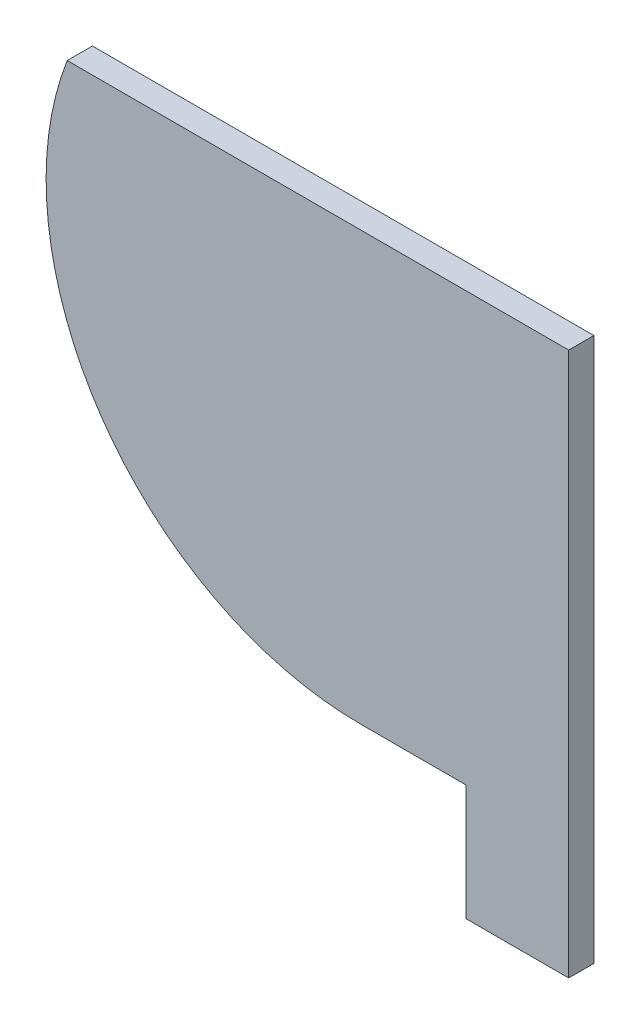
ISO-10303-21;
HEADER;
FILE_DESCRIPTION(('STEP AP214'),'2;1');
FILE_NAME('part.step','',(''),(''),'','','');
FILE_SCHEMA(('AUTOMOTIVE_DESIGN { 1 0 10303 214 1 1 1 1 }'));
ENDSEC;
DATA;
#1=APPLICATION_CONTEXT('core data for automotive mechanical design processes');
#2=APPLICATION_PROTOCOL_DEFINITION('international standard','automotive_design',2000,#1);
#3=PRODUCT_CONTEXT('',#1,'mechanical');
#4=PRODUCT('Part','Part','',(#3));
#5=PRODUCT_RELATED_PRODUCT_CATEGORY('part','',(#4));
#6=PRODUCT_DEFINITION_FORMATION('','',#4);
#7=PRODUCT_DEFINITION_CONTEXT('part definition',#1,'design');
#8=PRODUCT_DEFINITION('design','',#6,#7);
#9=PRODUCT_DEFINITION_SHAPE('','',#8);
#10=(LENGTH_UNIT() NAMED_UNIT(*) SI_UNIT(.MILLI.,.METRE.));
#11=(NAMED_UNIT(*) PLANE_ANGLE_UNIT() SI_UNIT($,.RADIAN.));
#12=(NAMED_UNIT(*) SI_UNIT($,.STERADIAN.) SOLID_ANGLE_UNIT());
#13=UNCERTAINTY_MEASURE_WITH_UNIT(LENGTH_MEASURE(1.E-05),#10,'distance_accuracy_value','');
#14=(GEOMETRIC_REPRESENTATION_CONTEXT(3) GLOBAL_UNCERTAINTY_ASSIGNED_CONTEXT((#13)) GLOBAL_UNIT_ASSIGNED_CONTEXT((#10,
#11,#12)) REPRESENTATION_CONTEXT('',''));
#15=CARTESIAN_POINT('',(0.,0.,0.));
#16=DIRECTION('',(0.,0.,1.));
#17=DIRECTION('',(1.,0.,0.));
#18=AXIS2_PLACEMENT_3D('',#15,#16,#17);
#19=CARTESIAN_POINT('',(-41.2805747146211,-85.,5.));
#20=DIRECTION('',(0.,1.,0.));
#21=DIRECTION('',(0.,0.,1.));
#22=AXIS2_PLACEMENT_3D('',#19,#20,#21);
#23=PLANE('',#22);
#24=DIRECTION('',(1.,0.,0.));
#25=VECTOR('',#24,1.);
#26=CARTESIAN_POINT('',(-41.2805747146211,-85.,0.));
#27=LINE('',#26,#25);
#28=CARTESIAN_POINT('',(-41.2805747146211,-85.,0.));
#29=VERTEX_POINT('',#28);
#30=CARTESIAN_POINT('',(-20.3801822065286,-85.,0.));
#31=VERTEX_POINT('',#30);
#32=EDGE_CURVE('E54',#29,#31,#27,.T.);
#33=ORIENTED_EDGE('',*,*,#32,.T.);
#34=DIRECTION('',(0.,0.,1.));
#35=VECTOR('',#34,1.);
#36=CARTESIAN_POINT('',(-20.3801822065286,-85.,0.));
#37=LINE('',#36,#35);
#38=CARTESIAN_POINT('',(-20.3801822065286,-85.,5.));
#39=VERTEX_POINT('',#38);
#40=EDGE_CURVE('E49',#31,#39,#37,.T.);
#41=ORIENTED_EDGE('',*,*,#40,.T.);
#42=DIRECTION('',(1.,0.,0.));
#43=VECTOR('',#42,1.);
#44=CARTESIAN_POINT('',(-41.2805747146211,-85.,5.));
#45=LINE('',#44,#43);
#46=CARTESIAN_POINT('',(-41.2805747146211,-85.,5.));
#47=VERTEX_POINT('',#46);
#48=EDGE_CURVE('E116',#47,#39,#45,.T.);
#49=ORIENTED_EDGE('',*,*,#48,.F.);
#50=DIRECTION('',(0.,0.,-1.));
#51=VECTOR('',#50,1.);
#52=CARTESIAN_POINT('',(-41.2805747146211,-85.,5.));
#53=LINE('',#52,#51);
#54=EDGE_CURVE('E125',#47,#29,#53,.T.);
#55=ORIENTED_EDGE('',*,*,#54,.T.);
#56=EDGE_LOOP('',(#33,#41,#49,#55));
#57=FACE_BOUND('',#56,.T.);
#58=ADVANCED_FACE('F35',(#57),#23,.F.);
#59=CARTESIAN_POINT('',(0.,0.,5.));
#60=DIRECTION('',(-1.,0.,0.));
#61=DIRECTION('',(0.,-1.,0.));
#62=AXIS2_PLACEMENT_3D('',#59,#60,#61);
#63=PLANE('',#62);
#64=DIRECTION('',(0.,1.,0.));
#65=VECTOR('',#64,1.);
#66=CARTESIAN_POINT('',(0.,0.,0.));
#67=LINE('',#66,#65);
#68=CARTESIAN_POINT('',(0.,-108.,0.));
#69=VERTEX_POINT('',#68);
#70=CARTESIAN_POINT('',(0.,0.,0.));
#71=VERTEX_POINT('',#70);
#72=EDGE_CURVE('E105',#69,#71,#67,.T.);
#73=ORIENTED_EDGE('',*,*,#72,.T.);
#74=DIRECTION('',(0.,0.,-1.));
#75=VECTOR('',#74,1.);
#76=CARTESIAN_POINT('',(0.,0.,5.));
#77=LINE('',#76,#75);
#78=CARTESIAN_POINT('',(0.,0.,5.));
#79=VERTEX_POINT('',#78);
#80=EDGE_CURVE('E11',#79,#71,#77,.T.);
#81=ORIENTED_EDGE('',*,*,#80,.F.);
#82=DIRECTION('',(0.,1.,0.));
#83=VECTOR('',#82,1.);
#84=CARTESIAN_POINT('',(0.,0.,5.));
#85=LINE('',#84,#83);
#86=CARTESIAN_POINT('',(0.,-108.,5.));
#87=VERTEX_POINT('',#86);
#88=EDGE_CURVE('E118',#87,#79,#85,.T.);
#89=ORIENTED_EDGE('',*,*,#88,.F.);
#90=DIRECTION('',(0.,0.,1.));
#91=VECTOR('',#90,1.);
#92=CARTESIAN_POINT('',(0.,-108.,0.));
#93=LINE('',#92,#91);
#94=EDGE_CURVE('E98',#69,#87,#93,.T.);
#95=ORIENTED_EDGE('',*,*,#94,.F.);
#96=EDGE_LOOP('',(#73,#81,#89,#95));
#97=FACE_BOUND('',#96,.T.);
#98=ADVANCED_FACE('F143',(#97),#63,.F.);
#99=CARTESIAN_POINT('',(0.,0.,5.));
#100=DIRECTION('',(0.,-1.,0.));
#101=DIRECTION('',(1.,0.,0.));
#102=AXIS2_PLACEMENT_3D('',#99,#100,#101);
#103=PLANE('',#102);
#104=DIRECTION('',(-1.,0.,0.));
#105=VECTOR('',#104,1.);
#106=CARTESIAN_POINT('',(0.,0.,0.));
#107=LINE('',#106,#105);
#108=CARTESIAN_POINT('',(-99.5900936630741,0.,0.));
#109=VERTEX_POINT('',#108);
#110=EDGE_CURVE('E128',#71,#109,#107,.T.);
#111=ORIENTED_EDGE('',*,*,#110,.T.);
#112=DIRECTION('',(0.,0.,-1.));
#113=VECTOR('',#112,1.);
#114=CARTESIAN_POINT('',(-99.5900936630741,0.,5.));
#115=LINE('',#114,#113);
#116=CARTESIAN_POINT('',(-99.5900936630741,0.,5.));
#117=VERTEX_POINT('',#116);
#118=EDGE_CURVE('E42',#117,#109,#115,.T.);
#119=ORIENTED_EDGE('',*,*,#118,.F.);
#120=DIRECTION('',(-1.,0.,0.));
#121=VECTOR('',#120,1.);
#122=CARTESIAN_POINT('',(0.,0.,5.));
#123=LINE('',#122,#121);
#124=EDGE_CURVE('E121',#79,#117,#123,.T.);
#125=ORIENTED_EDGE('',*,*,#124,.F.);
#126=ORIENTED_EDGE('',*,*,#80,.T.);
#127=EDGE_LOOP('',(#111,#119,#125,#126));
#128=FACE_BOUND('',#127,.T.);
#129=ADVANCED_FACE('F140',(#128),#103,.F.);
#130=CARTESIAN_POINT('',(-41.2805747146211,-22.5,5.));
#131=DIRECTION('',(0.,0.,-1.));
#132=DIRECTION('',(-1.,0.,0.));
#133=AXIS2_PLACEMENT_3D('',#130,#131,#132);
#134=CYLINDRICAL_SURFACE('',#133,62.5);
#135=CARTESIAN_POINT('',(-41.2805747146211,-22.5,0.));
#136=DIRECTION('',(0.,0.,1.));
#137=DIRECTION('',(1.,0.,0.));
#138=AXIS2_PLACEMENT_3D('',#135,#136,#137);
#139=CIRCLE('',#138,62.5);
#140=EDGE_CURVE('E119',#109,#29,#139,.T.);
#141=ORIENTED_EDGE('',*,*,#140,.T.);
#142=ORIENTED_EDGE('',*,*,#54,.F.);
#143=CARTESIAN_POINT('',(-41.2805747146211,-22.5,5.));
#144=DIRECTION('',(0.,0.,1.));
#145=DIRECTION('',(1.,0.,0.));
#146=AXIS2_PLACEMENT_3D('',#143,#144,#145);
#147=CIRCLE('',#146,62.5);
#148=EDGE_CURVE('E123',#117,#47,#147,.T.);
#149=ORIENTED_EDGE('',*,*,#148,.F.);
#150=ORIENTED_EDGE('',*,*,#118,.T.);
#151=EDGE_LOOP('',(#141,#142,#149,#150));
#152=FACE_BOUND('',#151,.T.);
#153=ADVANCED_FACE('F136',(#152),#134,.T.);
#154=CARTESIAN_POINT('',(-41.2805747146211,-22.5,5.));
#155=DIRECTION('',(0.,0.,1.));
#156=DIRECTION('',(1.,0.,0.));
#157=AXIS2_PLACEMENT_3D('',#154,#155,#156);
#158=PLANE('',#157);
#159=ORIENTED_EDGE('',*,*,#48,.T.);
#160=DIRECTION('',(0.,-1.,0.));
#161=VECTOR('',#160,1.);
#162=CARTESIAN_POINT('',(-20.3801822065286,-85.,5.));
#163=LINE('',#162,#161);
#164=CARTESIAN_POINT('',(-20.3801822065286,-108.,5.));
#165=VERTEX_POINT('',#164);
#166=EDGE_CURVE('E110',#39,#165,#163,.T.);
#167=ORIENTED_EDGE('',*,*,#166,.T.);
#168=DIRECTION('',(1.,0.,0.));
#169=VECTOR('',#168,1.);
#170=CARTESIAN_POINT('',(-20.3801822065286,-108.,5.));
#171=LINE('',#170,#169);
#172=EDGE_CURVE('E93',#165,#87,#171,.T.);
#173=ORIENTED_EDGE('',*,*,#172,.T.);
#174=ORIENTED_EDGE('',*,*,#88,.T.);
#175=ORIENTED_EDGE('',*,*,#124,.T.);
#176=ORIENTED_EDGE('',*,*,#148,.T.);
#177=EDGE_LOOP('',(#159,#167,#173,#174,#175,#176));
#178=FACE_BOUND('',#177,.T.);
#179=ADVANCED_FACE('F145',(#178),#158,.T.);
#180=CARTESIAN_POINT('',(-41.2805747146211,-22.5,0.));
#181=DIRECTION('',(0.,0.,1.));
#182=DIRECTION('',(1.,0.,0.));
#183=AXIS2_PLACEMENT_3D('',#180,#181,#182);
#184=PLANE('',#183);
#185=ORIENTED_EDGE('',*,*,#32,.F.);
#186=ORIENTED_EDGE('',*,*,#140,.F.);
#187=ORIENTED_EDGE('',*,*,#110,.F.);
#188=ORIENTED_EDGE('',*,*,#72,.F.);
#189=DIRECTION('',(1.,0.,0.));
#190=VECTOR('',#189,1.);
#191=CARTESIAN_POINT('',(-20.3801822065286,-108.,0.));
#192=LINE('',#191,#190);
#193=CARTESIAN_POINT('',(-20.3801822065286,-108.,0.));
#194=VERTEX_POINT('',#193);
#195=EDGE_CURVE('E91',#194,#69,#192,.T.);
#196=ORIENTED_EDGE('',*,*,#195,.F.);
#197=DIRECTION('',(0.,-1.,0.));
#198=VECTOR('',#197,1.);
#199=CARTESIAN_POINT('',(-20.3801822065286,-85.,0.));
#200=LINE('',#199,#198);
#201=EDGE_CURVE('E103',#31,#194,#200,.T.);
#202=ORIENTED_EDGE('',*,*,#201,.F.);
#203=EDGE_LOOP('',(#185,#186,#187,#188,#196,#202));
#204=FACE_BOUND('',#203,.T.);
#205=ADVANCED_FACE('F102',(#204),#184,.F.);
#206=CARTESIAN_POINT('',(-20.3801822065286,-108.,0.));
#207=DIRECTION('',(0.,-1.,0.));
#208=DIRECTION('',(0.,0.,-1.));
#209=AXIS2_PLACEMENT_3D('',#206,#207,#208);
#210=PLANE('',#209);
#211=ORIENTED_EDGE('',*,*,#172,.F.);
#212=DIRECTION('',(0.,0.,1.));
#213=VECTOR('',#212,1.);
#214=CARTESIAN_POINT('',(-20.3801822065286,-108.,0.));
#215=LINE('',#214,#213);
#216=EDGE_CURVE('E87',#194,#165,#215,.T.);
#217=ORIENTED_EDGE('',*,*,#216,.F.);
#218=ORIENTED_EDGE('',*,*,#195,.T.);
#219=ORIENTED_EDGE('',*,*,#94,.T.);
#220=EDGE_LOOP('',(#211,#217,#218,#219));
#221=FACE_BOUND('',#220,.T.);
#222=ADVANCED_FACE('F89',(#221),#210,.T.);
#223=CARTESIAN_POINT('',(-20.3801822065286,-85.,0.));
#224=DIRECTION('',(-1.,0.,0.));
#225=DIRECTION('',(0.,0.,1.));
#226=AXIS2_PLACEMENT_3D('',#223,#224,#225);
#227=PLANE('',#226);
#228=ORIENTED_EDGE('',*,*,#166,.F.);
#229=ORIENTED_EDGE('',*,*,#40,.F.);
#230=ORIENTED_EDGE('',*,*,#201,.T.);
#231=ORIENTED_EDGE('',*,*,#216,.T.);
#232=EDGE_LOOP('',(#228,#229,#230,#231));
#233=FACE_BOUND('',#232,.T.);
#234=ADVANCED_FACE('F108',(#233),#227,.T.);
#235=CLOSED_SHELL('',(#58,#98,#129,#153,#179,#205,#222,#234));
#236=MANIFOLD_SOLID_BREP('B2',#235);
#237=ADVANCED_BREP_SHAPE_REPRESENTATION('',(#18,#236),#14);
#238=SHAPE_DEFINITION_REPRESENTATION(#9,#237);
ENDSEC;
END-ISO-10303-21;
